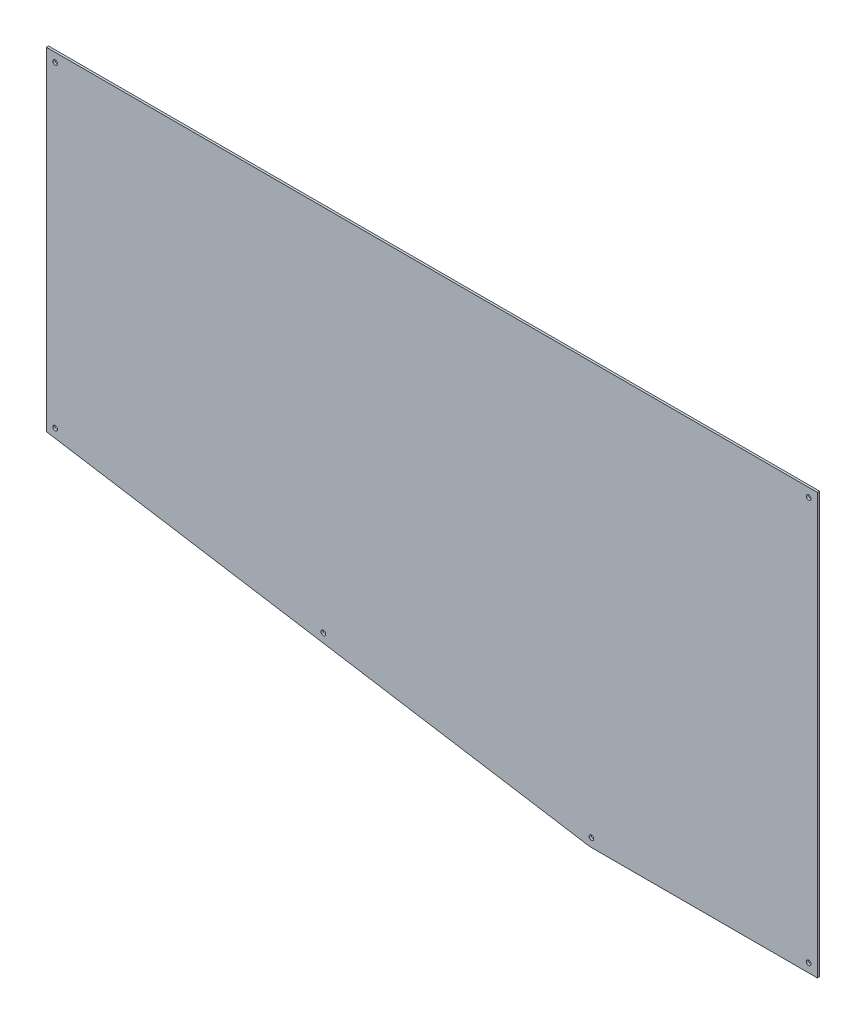
ISO-10303-21;
HEADER;
FILE_DESCRIPTION(('STEP AP214'),'2;1');
FILE_NAME('part.step','',(''),(''),'','','');
FILE_SCHEMA(('AUTOMOTIVE_DESIGN { 1 0 10303 214 1 1 1 1 }'));
ENDSEC;
DATA;
#1=APPLICATION_CONTEXT('core data for automotive mechanical design processes');
#2=APPLICATION_PROTOCOL_DEFINITION('international standard','automotive_design',2000,#1);
#3=PRODUCT_CONTEXT('',#1,'mechanical');
#4=PRODUCT('Part','Part','',(#3));
#5=PRODUCT_RELATED_PRODUCT_CATEGORY('part','',(#4));
#6=PRODUCT_DEFINITION_FORMATION('','',#4);
#7=PRODUCT_DEFINITION_CONTEXT('part definition',#1,'design');
#8=PRODUCT_DEFINITION('design','',#6,#7);
#9=PRODUCT_DEFINITION_SHAPE('','',#8);
#10=(LENGTH_UNIT() NAMED_UNIT(*) SI_UNIT(.MILLI.,.METRE.));
#11=(NAMED_UNIT(*) PLANE_ANGLE_UNIT() SI_UNIT($,.RADIAN.));
#12=(NAMED_UNIT(*) SI_UNIT($,.STERADIAN.) SOLID_ANGLE_UNIT());
#13=UNCERTAINTY_MEASURE_WITH_UNIT(LENGTH_MEASURE(1.E-05),#10,'distance_accuracy_value','');
#14=(GEOMETRIC_REPRESENTATION_CONTEXT(3) GLOBAL_UNCERTAINTY_ASSIGNED_CONTEXT((#13)) GLOBAL_UNIT_ASSIGNED_CONTEXT((#10,
#11,#12)) REPRESENTATION_CONTEXT('',''));
#15=CARTESIAN_POINT('',(0.,0.,0.));
#16=DIRECTION('',(0.,0.,1.));
#17=DIRECTION('',(1.,0.,0.));
#18=AXIS2_PLACEMENT_3D('',#15,#16,#17);
#19=CARTESIAN_POINT('',(0.,0.,3.175));
#20=DIRECTION('',(0.,0.,1.));
#21=DIRECTION('',(1.,0.,0.));
#22=AXIS2_PLACEMENT_3D('',#19,#20,#21);
#23=PLANE('',#22);
#24=CARTESIAN_POINT('',(790.053658449086,-597.163877521266,3.175));
#25=DIRECTION('',(0.,0.,1.));
#26=DIRECTION('',(1.,0.,0.));
#27=AXIS2_PLACEMENT_3D('',#24,#25,#26);
#28=CIRCLE('',#27,3.3655);
#29=CARTESIAN_POINT('',(793.419158449086,-597.163877521266,3.175));
#30=VERTEX_POINT('',#29);
#31=EDGE_CURVE('E106',#30,#30,#28,.F.);
#32=ORIENTED_EDGE('',*,*,#31,.T.);
#33=EDGE_LOOP('',(#32));
#34=FACE_BOUND('',#33,.T.);
#35=CARTESIAN_POINT('',(401.37682922467,-534.4740663558,3.175));
#36=DIRECTION('',(0.,0.,1.));
#37=DIRECTION('',(1.,0.,0.));
#38=AXIS2_PLACEMENT_3D('',#35,#36,#37);
#39=CIRCLE('',#38,3.3655);
#40=CARTESIAN_POINT('',(404.74232922467,-534.4740663558,3.175));
#41=VERTEX_POINT('',#40);
#42=EDGE_CURVE('E109',#41,#41,#39,.F.);
#43=ORIENTED_EDGE('',*,*,#42,.T.);
#44=EDGE_LOOP('',(#43));
#45=FACE_BOUND('',#44,.T.);
#46=CARTESIAN_POINT('',(1104.9,-596.9,3.175));
#47=DIRECTION('',(0.,0.,1.));
#48=DIRECTION('',(1.,0.,0.));
#49=AXIS2_PLACEMENT_3D('',#46,#47,#48);
#50=CIRCLE('',#49,3.3655);
#51=CARTESIAN_POINT('',(1108.2655,-596.9,3.175));
#52=VERTEX_POINT('',#51);
#53=EDGE_CURVE('E112',#52,#52,#50,.F.);
#54=ORIENTED_EDGE('',*,*,#53,.T.);
#55=EDGE_LOOP('',(#54));
#56=FACE_BOUND('',#55,.T.);
#57=CARTESIAN_POINT('',(1104.9,-12.7,3.175));
#58=DIRECTION('',(0.,0.,1.));
#59=DIRECTION('',(1.,0.,0.));
#60=AXIS2_PLACEMENT_3D('',#57,#58,#59);
#61=CIRCLE('',#60,3.3655);
#62=CARTESIAN_POINT('',(1108.2655,-12.7,3.175));
#63=VERTEX_POINT('',#62);
#64=EDGE_CURVE('E115',#63,#63,#61,.F.);
#65=ORIENTED_EDGE('',*,*,#64,.T.);
#66=EDGE_LOOP('',(#65));
#67=FACE_BOUND('',#66,.T.);
#68=CARTESIAN_POINT('',(12.7,-471.784255190588,3.175));
#69=DIRECTION('',(0.,0.,1.));
#70=DIRECTION('',(1.,0.,0.));
#71=AXIS2_PLACEMENT_3D('',#68,#69,#70);
#72=CIRCLE('',#71,3.3655);
#73=CARTESIAN_POINT('',(16.0655,-471.784255190588,3.175));
#74=VERTEX_POINT('',#73);
#75=EDGE_CURVE('E117',#74,#74,#72,.F.);
#76=ORIENTED_EDGE('',*,*,#75,.T.);
#77=EDGE_LOOP('',(#76));
#78=FACE_BOUND('',#77,.T.);
#79=CARTESIAN_POINT('',(12.7,-12.7,3.175));
#80=DIRECTION('',(0.,0.,1.));
#81=DIRECTION('',(1.,0.,0.));
#82=AXIS2_PLACEMENT_3D('',#79,#80,#81);
#83=CIRCLE('',#82,3.3655);
#84=CARTESIAN_POINT('',(16.0655,-12.7,3.175));
#85=VERTEX_POINT('',#84);
#86=EDGE_CURVE('E20',#85,#85,#83,.F.);
#87=ORIENTED_EDGE('',*,*,#86,.T.);
#88=EDGE_LOOP('',(#87));
#89=FACE_BOUND('',#88,.T.);
#90=DIRECTION('',(1.,0.,0.));
#91=VECTOR('',#90,1.);
#92=CARTESIAN_POINT('',(1117.6,0.,3.175));
#93=LINE('',#92,#91);
#94=CARTESIAN_POINT('',(0.,0.,3.175));
#95=VERTEX_POINT('',#94);
#96=CARTESIAN_POINT('',(1117.6,0.,3.175));
#97=VERTEX_POINT('',#96);
#98=EDGE_CURVE('E79',#95,#97,#93,.T.);
#99=ORIENTED_EDGE('',*,*,#98,.F.);
#100=DIRECTION('',(0.,1.,0.));
#101=VECTOR('',#100,1.);
#102=CARTESIAN_POINT('',(0.,0.,3.175));
#103=LINE('',#102,#101);
#104=CARTESIAN_POINT('',(0.,-482.6,3.175));
#105=VERTEX_POINT('',#104);
#106=EDGE_CURVE('E75',#105,#95,#103,.T.);
#107=ORIENTED_EDGE('',*,*,#106,.F.);
#108=DIRECTION('',(0.987241120712649,-0.159232438824608,0.));
#109=VECTOR('',#108,1.);
#110=CARTESIAN_POINT('',(0.,-482.6,3.175));
#111=LINE('',#110,#109);
#112=CARTESIAN_POINT('',(787.4,-609.599999999998,3.175));
#113=VERTEX_POINT('',#112);
#114=EDGE_CURVE('E66',#113,#105,#111,.F.);
#115=ORIENTED_EDGE('',*,*,#114,.F.);
#116=DIRECTION('',(1.,0.,0.));
#117=VECTOR('',#116,1.);
#118=CARTESIAN_POINT('',(787.4,-609.6,3.175));
#119=LINE('',#118,#117);
#120=CARTESIAN_POINT('',(1117.6,-609.6,3.175));
#121=VERTEX_POINT('',#120);
#122=EDGE_CURVE('E61',#121,#113,#119,.F.);
#123=ORIENTED_EDGE('',*,*,#122,.F.);
#124=DIRECTION('',(0.,1.,0.));
#125=VECTOR('',#124,1.);
#126=CARTESIAN_POINT('',(1117.6,-609.6,3.175));
#127=LINE('',#126,#125);
#128=EDGE_CURVE('E133',#97,#121,#127,.F.);
#129=ORIENTED_EDGE('',*,*,#128,.F.);
#130=EDGE_LOOP('',(#99,#107,#115,#123,#129));
#131=FACE_BOUND('',#130,.T.);
#132=ADVANCED_FACE('F17',(#34,#45,#56,#67,#78,#89,#131),#23,.T.);
#133=CARTESIAN_POINT('',(0.,0.,0.));
#134=DIRECTION('',(-1.,0.,0.));
#135=DIRECTION('',(0.,0.,1.));
#136=AXIS2_PLACEMENT_3D('',#133,#134,#135);
#137=PLANE('',#136);
#138=DIRECTION('',(0.,0.,1.));
#139=VECTOR('',#138,1.);
#140=CARTESIAN_POINT('',(0.,0.,0.));
#141=LINE('',#140,#139);
#142=CARTESIAN_POINT('',(0.,0.,0.));
#143=VERTEX_POINT('',#142);
#144=EDGE_CURVE('E125',#143,#95,#141,.T.);
#145=ORIENTED_EDGE('',*,*,#144,.F.);
#146=DIRECTION('',(0.,1.,0.));
#147=VECTOR('',#146,1.);
#148=CARTESIAN_POINT('',(0.,0.,0.));
#149=LINE('',#148,#147);
#150=CARTESIAN_POINT('',(0.,-482.6,0.));
#151=VERTEX_POINT('',#150);
#152=EDGE_CURVE('E86',#143,#151,#149,.F.);
#153=ORIENTED_EDGE('',*,*,#152,.T.);
#154=DIRECTION('',(0.,0.,1.));
#155=VECTOR('',#154,1.);
#156=CARTESIAN_POINT('',(0.,-482.6,0.));
#157=LINE('',#156,#155);
#158=EDGE_CURVE('E71',#105,#151,#157,.F.);
#159=ORIENTED_EDGE('',*,*,#158,.F.);
#160=ORIENTED_EDGE('',*,*,#106,.T.);
#161=EDGE_LOOP('',(#145,#153,#159,#160));
#162=FACE_BOUND('',#161,.T.);
#163=ADVANCED_FACE('F85',(#162),#137,.T.);
#164=CARTESIAN_POINT('',(0.,-482.6,0.));
#165=DIRECTION('',(-0.159232438824608,-0.987241120712649,0.));
#166=DIRECTION('',(0.987241120712649,-0.159232438824608,0.));
#167=AXIS2_PLACEMENT_3D('',#164,#165,#166);
#168=PLANE('',#167);
#169=ORIENTED_EDGE('',*,*,#158,.T.);
#170=DIRECTION('',(0.987241120712647,-0.15923243882462,0.));
#171=VECTOR('',#170,1.);
#172=CARTESIAN_POINT('',(0.,-482.6,0.));
#173=LINE('',#172,#171);
#174=CARTESIAN_POINT('',(787.400000000001,-609.599999999995,0.));
#175=VERTEX_POINT('',#174);
#176=EDGE_CURVE('E141',#151,#175,#173,.T.);
#177=ORIENTED_EDGE('',*,*,#176,.T.);
#178=DIRECTION('',(0.,0.,-1.));
#179=VECTOR('',#178,1.);
#180=CARTESIAN_POINT('',(787.4,-609.6,0.));
#181=LINE('',#180,#179);
#182=EDGE_CURVE('E73',#113,#175,#181,.T.);
#183=ORIENTED_EDGE('',*,*,#182,.F.);
#184=ORIENTED_EDGE('',*,*,#114,.T.);
#185=EDGE_LOOP('',(#169,#177,#183,#184));
#186=FACE_BOUND('',#185,.T.);
#187=ADVANCED_FACE('F68',(#186),#168,.T.);
#188=CARTESIAN_POINT('',(787.4,-609.6,0.));
#189=DIRECTION('',(0.,-1.,0.));
#190=DIRECTION('',(0.,0.,-1.));
#191=AXIS2_PLACEMENT_3D('',#188,#189,#190);
#192=PLANE('',#191);
#193=ORIENTED_EDGE('',*,*,#182,.T.);
#194=DIRECTION('',(1.,0.,0.));
#195=VECTOR('',#194,1.);
#196=CARTESIAN_POINT('',(0.,-609.6,0.));
#197=LINE('',#196,#195);
#198=CARTESIAN_POINT('',(1117.6,-609.6,0.));
#199=VERTEX_POINT('',#198);
#200=EDGE_CURVE('E137',#175,#199,#197,.T.);
#201=ORIENTED_EDGE('',*,*,#200,.T.);
#202=DIRECTION('',(0.,0.,-1.));
#203=VECTOR('',#202,1.);
#204=CARTESIAN_POINT('',(1117.6,-609.6,0.));
#205=LINE('',#204,#203);
#206=EDGE_CURVE('E131',#121,#199,#205,.T.);
#207=ORIENTED_EDGE('',*,*,#206,.F.);
#208=ORIENTED_EDGE('',*,*,#122,.T.);
#209=EDGE_LOOP('',(#193,#201,#207,#208));
#210=FACE_BOUND('',#209,.T.);
#211=ADVANCED_FACE('F136',(#210),#192,.T.);
#212=CARTESIAN_POINT('',(1117.6,-609.6,0.));
#213=DIRECTION('',(1.,0.,0.));
#214=DIRECTION('',(0.,0.,-1.));
#215=AXIS2_PLACEMENT_3D('',#212,#213,#214);
#216=PLANE('',#215);
#217=ORIENTED_EDGE('',*,*,#206,.T.);
#218=DIRECTION('',(0.,1.,0.));
#219=VECTOR('',#218,1.);
#220=CARTESIAN_POINT('',(1117.6,0.,0.));
#221=LINE('',#220,#219);
#222=CARTESIAN_POINT('',(1117.6,0.,0.));
#223=VERTEX_POINT('',#222);
#224=EDGE_CURVE('E143',#199,#223,#221,.T.);
#225=ORIENTED_EDGE('',*,*,#224,.T.);
#226=DIRECTION('',(0.,0.,1.));
#227=VECTOR('',#226,1.);
#228=CARTESIAN_POINT('',(1117.6,0.,0.));
#229=LINE('',#228,#227);
#230=EDGE_CURVE('E35',#97,#223,#229,.F.);
#231=ORIENTED_EDGE('',*,*,#230,.F.);
#232=ORIENTED_EDGE('',*,*,#128,.T.);
#233=EDGE_LOOP('',(#217,#225,#231,#232));
#234=FACE_BOUND('',#233,.T.);
#235=ADVANCED_FACE('F149',(#234),#216,.T.);
#236=CARTESIAN_POINT('',(1117.6,0.,0.));
#237=DIRECTION('',(0.,1.,0.));
#238=DIRECTION('',(0.,0.,1.));
#239=AXIS2_PLACEMENT_3D('',#236,#237,#238);
#240=PLANE('',#239);
#241=ORIENTED_EDGE('',*,*,#230,.T.);
#242=DIRECTION('',(1.,0.,0.));
#243=VECTOR('',#242,1.);
#244=CARTESIAN_POINT('',(0.,0.,0.));
#245=LINE('',#244,#243);
#246=EDGE_CURVE('E105',#223,#143,#245,.F.);
#247=ORIENTED_EDGE('',*,*,#246,.T.);
#248=ORIENTED_EDGE('',*,*,#144,.T.);
#249=ORIENTED_EDGE('',*,*,#98,.T.);
#250=EDGE_LOOP('',(#241,#247,#248,#249));
#251=FACE_BOUND('',#250,.T.);
#252=ADVANCED_FACE('F147',(#251),#240,.T.);
#253=CARTESIAN_POINT('',(12.7,-12.7,3.175));
#254=DIRECTION('',(0.,0.,1.));
#255=DIRECTION('',(1.,0.,0.));
#256=AXIS2_PLACEMENT_3D('',#253,#254,#255);
#257=CYLINDRICAL_SURFACE('',#256,3.3655);
#258=CARTESIAN_POINT('',(12.7,-12.7,0.));
#259=DIRECTION('',(0.,0.,1.));
#260=DIRECTION('',(1.,0.,0.));
#261=AXIS2_PLACEMENT_3D('',#258,#259,#260);
#262=CIRCLE('',#261,3.3655);
#263=CARTESIAN_POINT('',(16.0655,-12.7,0.));
#264=VERTEX_POINT('',#263);
#265=EDGE_CURVE('E102',#264,#264,#262,.F.);
#266=ORIENTED_EDGE('',*,*,#265,.T.);
#267=EDGE_LOOP('',(#266));
#268=FACE_BOUND('',#267,.T.);
#269=ORIENTED_EDGE('',*,*,#86,.F.);
#270=EDGE_LOOP('',(#269));
#271=FACE_BOUND('',#270,.T.);
#272=ADVANCED_FACE('F157',(#268,#271),#257,.F.);
#273=CARTESIAN_POINT('',(12.7,-471.784255190588,3.175));
#274=DIRECTION('',(0.,0.,1.));
#275=DIRECTION('',(1.,0.,0.));
#276=AXIS2_PLACEMENT_3D('',#273,#274,#275);
#277=CYLINDRICAL_SURFACE('',#276,3.3655);
#278=CARTESIAN_POINT('',(12.7,-471.784255190588,0.));
#279=DIRECTION('',(0.,0.,1.));
#280=DIRECTION('',(1.,0.,0.));
#281=AXIS2_PLACEMENT_3D('',#278,#279,#280);
#282=CIRCLE('',#281,3.3655);
#283=CARTESIAN_POINT('',(16.0655,-471.784255190588,0.));
#284=VERTEX_POINT('',#283);
#285=EDGE_CURVE('E99',#284,#284,#282,.F.);
#286=ORIENTED_EDGE('',*,*,#285,.T.);
#287=EDGE_LOOP('',(#286));
#288=FACE_BOUND('',#287,.T.);
#289=ORIENTED_EDGE('',*,*,#75,.F.);
#290=EDGE_LOOP('',(#289));
#291=FACE_BOUND('',#290,.T.);
#292=ADVANCED_FACE('F183',(#288,#291),#277,.F.);
#293=CARTESIAN_POINT('',(1104.9,-12.7,3.175));
#294=DIRECTION('',(0.,0.,1.));
#295=DIRECTION('',(1.,0.,0.));
#296=AXIS2_PLACEMENT_3D('',#293,#294,#295);
#297=CYLINDRICAL_SURFACE('',#296,3.3655);
#298=CARTESIAN_POINT('',(1104.9,-12.7,0.));
#299=DIRECTION('',(0.,0.,1.));
#300=DIRECTION('',(1.,0.,0.));
#301=AXIS2_PLACEMENT_3D('',#298,#299,#300);
#302=CIRCLE('',#301,3.3655);
#303=CARTESIAN_POINT('',(1108.2655,-12.7,0.));
#304=VERTEX_POINT('',#303);
#305=EDGE_CURVE('E96',#304,#304,#302,.F.);
#306=ORIENTED_EDGE('',*,*,#305,.T.);
#307=EDGE_LOOP('',(#306));
#308=FACE_BOUND('',#307,.T.);
#309=ORIENTED_EDGE('',*,*,#64,.F.);
#310=EDGE_LOOP('',(#309));
#311=FACE_BOUND('',#310,.T.);
#312=ADVANCED_FACE('F179',(#308,#311),#297,.F.);
#313=CARTESIAN_POINT('',(1104.9,-596.9,3.175));
#314=DIRECTION('',(0.,0.,1.));
#315=DIRECTION('',(1.,0.,0.));
#316=AXIS2_PLACEMENT_3D('',#313,#314,#315);
#317=CYLINDRICAL_SURFACE('',#316,3.3655);
#318=CARTESIAN_POINT('',(1104.9,-596.9,0.));
#319=DIRECTION('',(0.,0.,1.));
#320=DIRECTION('',(1.,0.,0.));
#321=AXIS2_PLACEMENT_3D('',#318,#319,#320);
#322=CIRCLE('',#321,3.3655);
#323=CARTESIAN_POINT('',(1108.2655,-596.9,0.));
#324=VERTEX_POINT('',#323);
#325=EDGE_CURVE('E93',#324,#324,#322,.F.);
#326=ORIENTED_EDGE('',*,*,#325,.T.);
#327=EDGE_LOOP('',(#326));
#328=FACE_BOUND('',#327,.T.);
#329=ORIENTED_EDGE('',*,*,#53,.F.);
#330=EDGE_LOOP('',(#329));
#331=FACE_BOUND('',#330,.T.);
#332=ADVANCED_FACE('F175',(#328,#331),#317,.F.);
#333=CARTESIAN_POINT('',(401.37682922467,-534.4740663558,3.175));
#334=DIRECTION('',(0.,0.,1.));
#335=DIRECTION('',(1.,0.,0.));
#336=AXIS2_PLACEMENT_3D('',#333,#334,#335);
#337=CYLINDRICAL_SURFACE('',#336,3.3655);
#338=ORIENTED_EDGE('',*,*,#42,.F.);
#339=EDGE_LOOP('',(#338));
#340=FACE_BOUND('',#339,.T.);
#341=CARTESIAN_POINT('',(401.37682922467,-534.4740663558,0.));
#342=DIRECTION('',(0.,0.,1.));
#343=DIRECTION('',(1.,0.,0.));
#344=AXIS2_PLACEMENT_3D('',#341,#342,#343);
#345=CIRCLE('',#344,3.3655);
#346=CARTESIAN_POINT('',(404.74232922467,-534.4740663558,0.));
#347=VERTEX_POINT('',#346);
#348=EDGE_CURVE('E26',#347,#347,#345,.F.);
#349=ORIENTED_EDGE('',*,*,#348,.T.);
#350=EDGE_LOOP('',(#349));
#351=FACE_BOUND('',#350,.T.);
#352=ADVANCED_FACE('F167',(#340,#351),#337,.F.);
#353=CARTESIAN_POINT('',(790.053658449086,-597.163877521266,3.175));
#354=DIRECTION('',(0.,0.,1.));
#355=DIRECTION('',(1.,0.,0.));
#356=AXIS2_PLACEMENT_3D('',#353,#354,#355);
#357=CYLINDRICAL_SURFACE('',#356,3.3655);
#358=ORIENTED_EDGE('',*,*,#31,.F.);
#359=EDGE_LOOP('',(#358));
#360=FACE_BOUND('',#359,.T.);
#361=CARTESIAN_POINT('',(790.053658449086,-597.163877521266,0.));
#362=DIRECTION('',(0.,0.,1.));
#363=DIRECTION('',(1.,0.,0.));
#364=AXIS2_PLACEMENT_3D('',#361,#362,#363);
#365=CIRCLE('',#364,3.3655);
#366=CARTESIAN_POINT('',(793.419158449086,-597.163877521266,0.));
#367=VERTEX_POINT('',#366);
#368=EDGE_CURVE('E11',#367,#367,#365,.F.);
#369=ORIENTED_EDGE('',*,*,#368,.T.);
#370=EDGE_LOOP('',(#369));
#371=FACE_BOUND('',#370,.T.);
#372=ADVANCED_FACE('F161',(#360,#371),#357,.F.);
#373=CARTESIAN_POINT('',(0.,0.,0.));
#374=DIRECTION('',(0.,0.,1.));
#375=DIRECTION('',(1.,0.,0.));
#376=AXIS2_PLACEMENT_3D('',#373,#374,#375);
#377=PLANE('',#376);
#378=ORIENTED_EDGE('',*,*,#368,.F.);
#379=EDGE_LOOP('',(#378));
#380=FACE_BOUND('',#379,.T.);
#381=ORIENTED_EDGE('',*,*,#348,.F.);
#382=EDGE_LOOP('',(#381));
#383=FACE_BOUND('',#382,.T.);
#384=ORIENTED_EDGE('',*,*,#325,.F.);
#385=EDGE_LOOP('',(#384));
#386=FACE_BOUND('',#385,.T.);
#387=ORIENTED_EDGE('',*,*,#305,.F.);
#388=EDGE_LOOP('',(#387));
#389=FACE_BOUND('',#388,.T.);
#390=ORIENTED_EDGE('',*,*,#285,.F.);
#391=EDGE_LOOP('',(#390));
#392=FACE_BOUND('',#391,.T.);
#393=ORIENTED_EDGE('',*,*,#265,.F.);
#394=EDGE_LOOP('',(#393));
#395=FACE_BOUND('',#394,.T.);
#396=ORIENTED_EDGE('',*,*,#224,.F.);
#397=ORIENTED_EDGE('',*,*,#200,.F.);
#398=ORIENTED_EDGE('',*,*,#176,.F.);
#399=ORIENTED_EDGE('',*,*,#152,.F.);
#400=ORIENTED_EDGE('',*,*,#246,.F.);
#401=EDGE_LOOP('',(#396,#397,#398,#399,#400));
#402=FACE_BOUND('',#401,.T.);
#403=ADVANCED_FACE('F140',(#380,#383,#386,#389,#392,#395,#402),#377,.F.);
#404=CLOSED_SHELL('',(#132,#163,#187,#211,#235,#252,#272,#292,#312,#332,#352,#372,#403));
#405=MANIFOLD_SOLID_BREP('B1',#404);
#406=ADVANCED_BREP_SHAPE_REPRESENTATION('',(#18,#405),#14);
#407=SHAPE_DEFINITION_REPRESENTATION(#9,#406);
ENDSEC;
END-ISO-10303-21;
